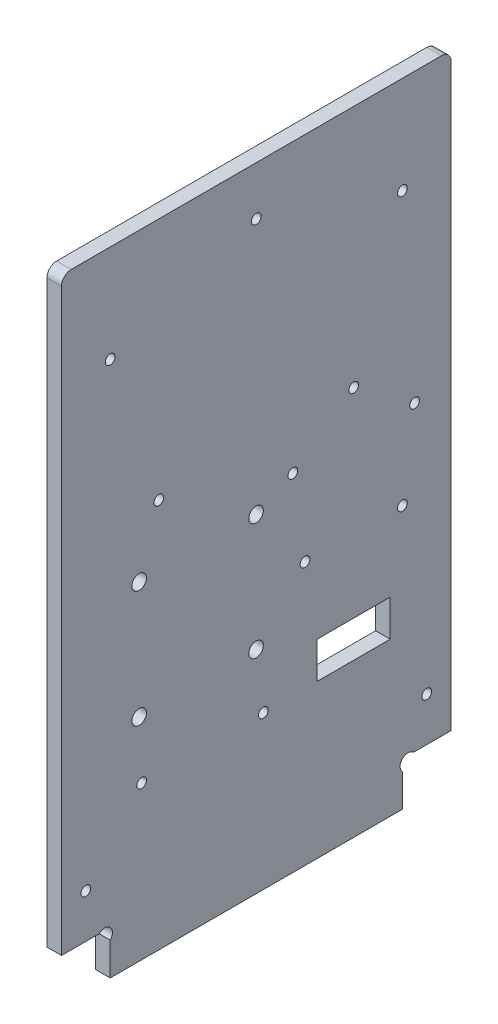
ISO-10303-21;
HEADER;
FILE_DESCRIPTION(('STEP AP214'),'2;1');
FILE_NAME('part.step','',(''),(''),'','','');
FILE_SCHEMA(('AUTOMOTIVE_DESIGN { 1 0 10303 214 1 1 1 1 }'));
ENDSEC;
DATA;
#1=APPLICATION_CONTEXT('core data for automotive mechanical design processes');
#2=APPLICATION_PROTOCOL_DEFINITION('international standard','automotive_design',2000,#1);
#3=PRODUCT_CONTEXT('',#1,'mechanical');
#4=PRODUCT('Part','Part','',(#3));
#5=PRODUCT_RELATED_PRODUCT_CATEGORY('part','',(#4));
#6=PRODUCT_DEFINITION_FORMATION('','',#4);
#7=PRODUCT_DEFINITION_CONTEXT('part definition',#1,'design');
#8=PRODUCT_DEFINITION('design','',#6,#7);
#9=PRODUCT_DEFINITION_SHAPE('','',#8);
#10=(LENGTH_UNIT() NAMED_UNIT(*) SI_UNIT(.MILLI.,.METRE.));
#11=(NAMED_UNIT(*) PLANE_ANGLE_UNIT() SI_UNIT($,.RADIAN.));
#12=(NAMED_UNIT(*) SI_UNIT($,.STERADIAN.) SOLID_ANGLE_UNIT());
#13=UNCERTAINTY_MEASURE_WITH_UNIT(LENGTH_MEASURE(1.E-05),#10,'distance_accuracy_value','');
#14=(GEOMETRIC_REPRESENTATION_CONTEXT(3) GLOBAL_UNCERTAINTY_ASSIGNED_CONTEXT((#13)) GLOBAL_UNIT_ASSIGNED_CONTEXT((#10,
#11,#12)) REPRESENTATION_CONTEXT('',''));
#15=CARTESIAN_POINT('',(0.,0.,0.));
#16=DIRECTION('',(0.,0.,1.));
#17=DIRECTION('',(1.,0.,0.));
#18=AXIS2_PLACEMENT_3D('',#15,#16,#17);
#19=CARTESIAN_POINT('',(3.,7.86862915010153,-8.86862915010152));
#20=DIRECTION('',(-1.,0.,0.));
#21=DIRECTION('',(0.,0.,1.));
#22=AXIS2_PLACEMENT_3D('',#19,#20,#21);
#23=CYLINDRICAL_SURFACE('',#22,1.6);
#24=CARTESIAN_POINT('',(0.,7.86862915010153,-8.86862915010152));
#25=DIRECTION('',(-1.,0.,0.));
#26=DIRECTION('',(0.,0.,-1.));
#27=AXIS2_PLACEMENT_3D('',#24,#25,#26);
#28=CIRCLE('',#27,1.6);
#29=CARTESIAN_POINT('',(0.,9.,-7.73725830020304));
#30=VERTEX_POINT('',#29);
#31=CARTESIAN_POINT('',(0.,6.73725830020305,-10.));
#32=VERTEX_POINT('',#31);
#33=EDGE_CURVE('E260',#30,#32,#28,.T.);
#34=ORIENTED_EDGE('',*,*,#33,.T.);
#35=DIRECTION('',(-1.,0.,0.));
#36=VECTOR('',#35,1.);
#37=CARTESIAN_POINT('',(3.,6.73725830020305,-10.));
#38=LINE('',#37,#36);
#39=CARTESIAN_POINT('',(3.,6.73725830020305,-10.));
#40=VERTEX_POINT('',#39);
#41=EDGE_CURVE('E326',#40,#32,#38,.T.);
#42=ORIENTED_EDGE('',*,*,#41,.F.);
#43=CARTESIAN_POINT('',(3.,7.86862915010153,-8.86862915010152));
#44=DIRECTION('',(-1.,0.,0.));
#45=DIRECTION('',(0.,0.,-1.));
#46=AXIS2_PLACEMENT_3D('',#43,#44,#45);
#47=CIRCLE('',#46,1.6);
#48=CARTESIAN_POINT('',(3.,9.,-7.73725830020304));
#49=VERTEX_POINT('',#48);
#50=EDGE_CURVE('E263',#49,#40,#47,.T.);
#51=ORIENTED_EDGE('',*,*,#50,.F.);
#52=DIRECTION('',(-1.,0.,0.));
#53=VECTOR('',#52,1.);
#54=CARTESIAN_POINT('',(3.,9.,-7.73725830020304));
#55=LINE('',#54,#53);
#56=EDGE_CURVE('E285',#49,#30,#55,.T.);
#57=ORIENTED_EDGE('',*,*,#56,.T.);
#58=EDGE_LOOP('',(#34,#42,#51,#57));
#59=FACE_BOUND('',#58,.T.);
#60=ADVANCED_FACE('F33',(#59),#23,.F.);
#61=CARTESIAN_POINT('',(3.,6.73725830020305,-10.));
#62=DIRECTION('',(0.,0.,-1.));
#63=DIRECTION('',(-1.,0.,0.));
#64=AXIS2_PLACEMENT_3D('',#61,#62,#63);
#65=PLANE('',#64);
#66=DIRECTION('',(0.,-1.,0.));
#67=VECTOR('',#66,1.);
#68=CARTESIAN_POINT('',(0.,6.73725830020305,-10.));
#69=LINE('',#68,#67);
#70=CARTESIAN_POINT('',(0.,0.,-10.));
#71=VERTEX_POINT('',#70);
#72=EDGE_CURVE('E288',#32,#71,#69,.T.);
#73=ORIENTED_EDGE('',*,*,#72,.T.);
#74=DIRECTION('',(-1.,0.,0.));
#75=VECTOR('',#74,1.);
#76=CARTESIAN_POINT('',(3.,0.,-10.));
#77=LINE('',#76,#75);
#78=CARTESIAN_POINT('',(3.,0.,-10.));
#79=VERTEX_POINT('',#78);
#80=EDGE_CURVE('E323',#79,#71,#77,.T.);
#81=ORIENTED_EDGE('',*,*,#80,.F.);
#82=DIRECTION('',(0.,-1.,0.));
#83=VECTOR('',#82,1.);
#84=CARTESIAN_POINT('',(3.,6.73725830020305,-10.));
#85=LINE('',#84,#83);
#86=EDGE_CURVE('E266',#40,#79,#85,.T.);
#87=ORIENTED_EDGE('',*,*,#86,.F.);
#88=ORIENTED_EDGE('',*,*,#41,.T.);
#89=EDGE_LOOP('',(#73,#81,#87,#88));
#90=FACE_BOUND('',#89,.T.);
#91=ADVANCED_FACE('F377',(#90),#65,.F.);
#92=CARTESIAN_POINT('',(3.,0.,-10.));
#93=DIRECTION('',(0.,1.,0.));
#94=DIRECTION('',(0.,0.,1.));
#95=AXIS2_PLACEMENT_3D('',#92,#93,#94);
#96=PLANE('',#95);
#97=DIRECTION('',(0.,0.,-1.));
#98=VECTOR('',#97,1.);
#99=CARTESIAN_POINT('',(0.,0.,-10.));
#100=LINE('',#99,#98);
#101=CARTESIAN_POINT('',(0.,0.,-70.));
#102=VERTEX_POINT('',#101);
#103=EDGE_CURVE('E290',#71,#102,#100,.T.);
#104=ORIENTED_EDGE('',*,*,#103,.T.);
#105=DIRECTION('',(-1.,0.,0.));
#106=VECTOR('',#105,1.);
#107=CARTESIAN_POINT('',(3.,0.,-70.));
#108=LINE('',#107,#106);
#109=CARTESIAN_POINT('',(3.,0.,-70.));
#110=VERTEX_POINT('',#109);
#111=EDGE_CURVE('E320',#110,#102,#108,.T.);
#112=ORIENTED_EDGE('',*,*,#111,.F.);
#113=DIRECTION('',(0.,0.,-1.));
#114=VECTOR('',#113,1.);
#115=CARTESIAN_POINT('',(3.,0.,-10.));
#116=LINE('',#115,#114);
#117=EDGE_CURVE('E269',#79,#110,#116,.T.);
#118=ORIENTED_EDGE('',*,*,#117,.F.);
#119=ORIENTED_EDGE('',*,*,#80,.T.);
#120=EDGE_LOOP('',(#104,#112,#118,#119));
#121=FACE_BOUND('',#120,.T.);
#122=ADVANCED_FACE('F371',(#121),#96,.F.);
#123=CARTESIAN_POINT('',(3.,6.73725830020307,-70.));
#124=DIRECTION('',(0.,0.,1.));
#125=DIRECTION('',(0.,-1.,0.));
#126=AXIS2_PLACEMENT_3D('',#123,#124,#125);
#127=PLANE('',#126);
#128=DIRECTION('',(0.,1.,0.));
#129=VECTOR('',#128,1.);
#130=CARTESIAN_POINT('',(0.,6.73725830020307,-70.));
#131=LINE('',#130,#129);
#132=CARTESIAN_POINT('',(0.,6.73725830020307,-70.));
#133=VERTEX_POINT('',#132);
#134=EDGE_CURVE('E292',#102,#133,#131,.T.);
#135=ORIENTED_EDGE('',*,*,#134,.T.);
#136=DIRECTION('',(-1.,0.,0.));
#137=VECTOR('',#136,1.);
#138=CARTESIAN_POINT('',(3.,6.73725830020307,-70.));
#139=LINE('',#138,#137);
#140=CARTESIAN_POINT('',(3.,6.73725830020307,-70.));
#141=VERTEX_POINT('',#140);
#142=EDGE_CURVE('E317',#141,#133,#139,.T.);
#143=ORIENTED_EDGE('',*,*,#142,.F.);
#144=DIRECTION('',(0.,1.,0.));
#145=VECTOR('',#144,1.);
#146=CARTESIAN_POINT('',(3.,6.73725830020307,-70.));
#147=LINE('',#146,#145);
#148=EDGE_CURVE('E271',#110,#141,#147,.T.);
#149=ORIENTED_EDGE('',*,*,#148,.F.);
#150=ORIENTED_EDGE('',*,*,#111,.T.);
#151=EDGE_LOOP('',(#135,#143,#149,#150));
#152=FACE_BOUND('',#151,.T.);
#153=ADVANCED_FACE('F367',(#152),#127,.F.);
#154=CARTESIAN_POINT('',(3.,7.86862915010154,-71.1313708498985));
#155=DIRECTION('',(-1.,0.,0.));
#156=DIRECTION('',(0.,0.,1.));
#157=AXIS2_PLACEMENT_3D('',#154,#155,#156);
#158=CYLINDRICAL_SURFACE('',#157,1.6);
#159=CARTESIAN_POINT('',(0.,7.86862915010154,-71.1313708498985));
#160=DIRECTION('',(-1.,0.,0.));
#161=DIRECTION('',(0.,0.,1.));
#162=AXIS2_PLACEMENT_3D('',#159,#160,#161);
#163=CIRCLE('',#162,1.6);
#164=CARTESIAN_POINT('',(0.,8.99999999999999,-72.262741699797));
#165=VERTEX_POINT('',#164);
#166=EDGE_CURVE('E294',#133,#165,#163,.T.);
#167=ORIENTED_EDGE('',*,*,#166,.T.);
#168=DIRECTION('',(-1.,0.,0.));
#169=VECTOR('',#168,1.);
#170=CARTESIAN_POINT('',(3.,8.99999999999999,-72.262741699797));
#171=LINE('',#170,#169);
#172=CARTESIAN_POINT('',(3.,8.99999999999999,-72.262741699797));
#173=VERTEX_POINT('',#172);
#174=EDGE_CURVE('E314',#173,#165,#171,.T.);
#175=ORIENTED_EDGE('',*,*,#174,.F.);
#176=CARTESIAN_POINT('',(3.,7.86862915010154,-71.1313708498985));
#177=DIRECTION('',(-1.,0.,0.));
#178=DIRECTION('',(0.,0.,1.));
#179=AXIS2_PLACEMENT_3D('',#176,#177,#178);
#180=CIRCLE('',#179,1.6);
#181=EDGE_CURVE('E273',#141,#173,#180,.T.);
#182=ORIENTED_EDGE('',*,*,#181,.F.);
#183=ORIENTED_EDGE('',*,*,#142,.T.);
#184=EDGE_LOOP('',(#167,#175,#182,#183));
#185=FACE_BOUND('',#184,.T.);
#186=ADVANCED_FACE('F362',(#185),#158,.F.);
#187=CARTESIAN_POINT('',(3.,8.99999999999999,-72.262741699797));
#188=DIRECTION('',(0.,1.,0.));
#189=DIRECTION('',(0.,0.,1.));
#190=AXIS2_PLACEMENT_3D('',#187,#188,#189);
#191=PLANE('',#190);
#192=DIRECTION('',(0.,0.,-1.));
#193=VECTOR('',#192,1.);
#194=CARTESIAN_POINT('',(0.,8.99999999999999,-72.262741699797));
#195=LINE('',#194,#193);
#196=CARTESIAN_POINT('',(0.,8.99999999999999,-80.));
#197=VERTEX_POINT('',#196);
#198=EDGE_CURVE('E296',#165,#197,#195,.T.);
#199=ORIENTED_EDGE('',*,*,#198,.T.);
#200=DIRECTION('',(-1.,0.,0.));
#201=VECTOR('',#200,1.);
#202=CARTESIAN_POINT('',(3.,8.99999999999999,-80.));
#203=LINE('',#202,#201);
#204=CARTESIAN_POINT('',(3.,8.99999999999999,-80.));
#205=VERTEX_POINT('',#204);
#206=EDGE_CURVE('E311',#205,#197,#203,.T.);
#207=ORIENTED_EDGE('',*,*,#206,.F.);
#208=DIRECTION('',(0.,0.,-1.));
#209=VECTOR('',#208,1.);
#210=CARTESIAN_POINT('',(3.,8.99999999999999,-72.262741699797));
#211=LINE('',#210,#209);
#212=EDGE_CURVE('E275',#173,#205,#211,.T.);
#213=ORIENTED_EDGE('',*,*,#212,.F.);
#214=ORIENTED_EDGE('',*,*,#174,.T.);
#215=EDGE_LOOP('',(#199,#207,#213,#214));
#216=FACE_BOUND('',#215,.T.);
#217=ADVANCED_FACE('F356',(#216),#191,.F.);
#218=CARTESIAN_POINT('',(3.,130.,-80.));
#219=DIRECTION('',(0.,0.,1.));
#220=DIRECTION('',(0.,-1.,0.));
#221=AXIS2_PLACEMENT_3D('',#218,#219,#220);
#222=PLANE('',#221);
#223=DIRECTION('',(0.,1.,0.));
#224=VECTOR('',#223,1.);
#225=CARTESIAN_POINT('',(0.,130.,-80.));
#226=LINE('',#225,#224);
#227=CARTESIAN_POINT('',(0.,128.,-80.));
#228=VERTEX_POINT('',#227);
#229=EDGE_CURVE('E298',#197,#228,#226,.T.);
#230=ORIENTED_EDGE('',*,*,#229,.T.);
#231=DIRECTION('',(-1.,0.,0.));
#232=VECTOR('',#231,1.);
#233=CARTESIAN_POINT('',(3.,128.,-80.));
#234=LINE('',#233,#232);
#235=CARTESIAN_POINT('',(3.,128.,-80.));
#236=VERTEX_POINT('',#235);
#237=EDGE_CURVE('E56',#228,#236,#234,.F.);
#238=ORIENTED_EDGE('',*,*,#237,.T.);
#239=DIRECTION('',(0.,1.,0.));
#240=VECTOR('',#239,1.);
#241=CARTESIAN_POINT('',(3.,130.,-80.));
#242=LINE('',#241,#240);
#243=EDGE_CURVE('E277',#205,#236,#242,.T.);
#244=ORIENTED_EDGE('',*,*,#243,.F.);
#245=ORIENTED_EDGE('',*,*,#206,.T.);
#246=EDGE_LOOP('',(#230,#238,#244,#245));
#247=FACE_BOUND('',#246,.T.);
#248=ADVANCED_FACE('F352',(#247),#222,.F.);
#249=CARTESIAN_POINT('',(3.,130.,0.));
#250=DIRECTION('',(0.,-1.,0.));
#251=DIRECTION('',(0.,0.,-1.));
#252=AXIS2_PLACEMENT_3D('',#249,#250,#251);
#253=PLANE('',#252);
#254=DIRECTION('',(0.,0.,1.));
#255=VECTOR('',#254,1.);
#256=CARTESIAN_POINT('',(3.,130.,0.));
#257=LINE('',#256,#255);
#258=CARTESIAN_POINT('',(3.,130.,-78.));
#259=VERTEX_POINT('',#258);
#260=CARTESIAN_POINT('',(3.,130.,-2.));
#261=VERTEX_POINT('',#260);
#262=EDGE_CURVE('E279',#259,#261,#257,.T.);
#263=ORIENTED_EDGE('',*,*,#262,.F.);
#264=DIRECTION('',(-1.,0.,0.));
#265=VECTOR('',#264,1.);
#266=CARTESIAN_POINT('',(3.,130.,-78.));
#267=LINE('',#266,#265);
#268=CARTESIAN_POINT('',(0.,130.,-78.));
#269=VERTEX_POINT('',#268);
#270=EDGE_CURVE('E331',#259,#269,#267,.T.);
#271=ORIENTED_EDGE('',*,*,#270,.T.);
#272=DIRECTION('',(0.,0.,1.));
#273=VECTOR('',#272,1.);
#274=CARTESIAN_POINT('',(0.,130.,0.));
#275=LINE('',#274,#273);
#276=CARTESIAN_POINT('',(0.,130.,-2.));
#277=VERTEX_POINT('',#276);
#278=EDGE_CURVE('E300',#269,#277,#275,.T.);
#279=ORIENTED_EDGE('',*,*,#278,.T.);
#280=DIRECTION('',(-1.,0.,0.));
#281=VECTOR('',#280,1.);
#282=CARTESIAN_POINT('',(3.,130.,-2.));
#283=LINE('',#282,#281);
#284=EDGE_CURVE('E329',#277,#261,#283,.F.);
#285=ORIENTED_EDGE('',*,*,#284,.T.);
#286=EDGE_LOOP('',(#263,#271,#279,#285));
#287=FACE_BOUND('',#286,.T.);
#288=ADVANCED_FACE('F344',(#287),#253,.F.);
#289=CARTESIAN_POINT('',(3.,9.,0.));
#290=DIRECTION('',(0.,0.,-1.));
#291=DIRECTION('',(-1.,0.,0.));
#292=AXIS2_PLACEMENT_3D('',#289,#290,#291);
#293=PLANE('',#292);
#294=DIRECTION('',(0.,-1.,0.));
#295=VECTOR('',#294,1.);
#296=CARTESIAN_POINT('',(3.,9.,0.));
#297=LINE('',#296,#295);
#298=CARTESIAN_POINT('',(3.,128.,0.));
#299=VERTEX_POINT('',#298);
#300=CARTESIAN_POINT('',(3.,9.,0.));
#301=VERTEX_POINT('',#300);
#302=EDGE_CURVE('E281',#299,#301,#297,.T.);
#303=ORIENTED_EDGE('',*,*,#302,.F.);
#304=DIRECTION('',(-1.,0.,0.));
#305=VECTOR('',#304,1.);
#306=CARTESIAN_POINT('',(3.,128.,0.));
#307=LINE('',#306,#305);
#308=CARTESIAN_POINT('',(0.,128.,0.));
#309=VERTEX_POINT('',#308);
#310=EDGE_CURVE('E11',#299,#309,#307,.T.);
#311=ORIENTED_EDGE('',*,*,#310,.T.);
#312=DIRECTION('',(0.,-1.,0.));
#313=VECTOR('',#312,1.);
#314=CARTESIAN_POINT('',(0.,9.,0.));
#315=LINE('',#314,#313);
#316=CARTESIAN_POINT('',(0.,9.,0.));
#317=VERTEX_POINT('',#316);
#318=EDGE_CURVE('E303',#309,#317,#315,.T.);
#319=ORIENTED_EDGE('',*,*,#318,.T.);
#320=DIRECTION('',(-1.,0.,0.));
#321=VECTOR('',#320,1.);
#322=CARTESIAN_POINT('',(3.,9.,0.));
#323=LINE('',#322,#321);
#324=EDGE_CURVE('E308',#301,#317,#323,.T.);
#325=ORIENTED_EDGE('',*,*,#324,.F.);
#326=EDGE_LOOP('',(#303,#311,#319,#325));
#327=FACE_BOUND('',#326,.T.);
#328=ADVANCED_FACE('F387',(#327),#293,.F.);
#329=CARTESIAN_POINT('',(3.,9.,-7.73725830020304));
#330=DIRECTION('',(0.,1.,0.));
#331=DIRECTION('',(0.,0.,1.));
#332=AXIS2_PLACEMENT_3D('',#329,#330,#331);
#333=PLANE('',#332);
#334=DIRECTION('',(0.,0.,-1.));
#335=VECTOR('',#334,1.);
#336=CARTESIAN_POINT('',(0.,9.,-7.73725830020304));
#337=LINE('',#336,#335);
#338=EDGE_CURVE('E267',#317,#30,#337,.T.);
#339=ORIENTED_EDGE('',*,*,#338,.T.);
#340=ORIENTED_EDGE('',*,*,#56,.F.);
#341=DIRECTION('',(0.,0.,-1.));
#342=VECTOR('',#341,1.);
#343=CARTESIAN_POINT('',(3.,9.,-7.73725830020304));
#344=LINE('',#343,#342);
#345=EDGE_CURVE('E283',#301,#49,#344,.T.);
#346=ORIENTED_EDGE('',*,*,#345,.F.);
#347=ORIENTED_EDGE('',*,*,#324,.T.);
#348=EDGE_LOOP('',(#339,#340,#346,#347));
#349=FACE_BOUND('',#348,.T.);
#350=ADVANCED_FACE('F383',(#349),#333,.F.);
#351=CARTESIAN_POINT('',(3.,7.86862915010153,-8.86862915010152));
#352=DIRECTION('',(1.,0.,0.));
#353=DIRECTION('',(0.,0.,-1.));
#354=AXIS2_PLACEMENT_3D('',#351,#352,#353);
#355=PLANE('',#354);
#356=CARTESIAN_POINT('',(3.,31.45,-16.45));
#357=DIRECTION('',(1.,0.,0.));
#358=DIRECTION('',(0.,0.,-1.));
#359=AXIS2_PLACEMENT_3D('',#356,#357,#358);
#360=CIRCLE('',#359,1.);
#361=CARTESIAN_POINT('',(3.,31.45,-17.45));
#362=VERTEX_POINT('',#361);
#363=EDGE_CURVE('E510',#362,#362,#360,.T.);
#364=ORIENTED_EDGE('',*,*,#363,.F.);
#365=EDGE_LOOP('',(#364));
#366=FACE_BOUND('',#365,.T.);
#367=CARTESIAN_POINT('',(3.,31.45,-41.45));
#368=DIRECTION('',(1.,0.,0.));
#369=DIRECTION('',(0.,0.,-1.));
#370=AXIS2_PLACEMENT_3D('',#367,#368,#369);
#371=CIRCLE('',#370,0.999999999999998);
#372=CARTESIAN_POINT('',(3.,31.45,-42.45));
#373=VERTEX_POINT('',#372);
#374=EDGE_CURVE('E515',#373,#373,#371,.T.);
#375=ORIENTED_EDGE('',*,*,#374,.F.);
#376=EDGE_LOOP('',(#375));
#377=FACE_BOUND('',#376,.T.);
#378=CARTESIAN_POINT('',(3.,71.,-47.5));
#379=DIRECTION('',(1.,0.,0.));
#380=DIRECTION('',(0.,0.,-1.));
#381=AXIS2_PLACEMENT_3D('',#378,#379,#380);
#382=CIRCLE('',#381,0.999999999999998);
#383=CARTESIAN_POINT('',(3.,71.,-48.5));
#384=VERTEX_POINT('',#383);
#385=EDGE_CURVE('E523',#384,#384,#382,.T.);
#386=ORIENTED_EDGE('',*,*,#385,.F.);
#387=EDGE_LOOP('',(#386));
#388=FACE_BOUND('',#387,.T.);
#389=CARTESIAN_POINT('',(3.,71.,-72.5));
#390=DIRECTION('',(1.,0.,0.));
#391=DIRECTION('',(0.,0.,-1.));
#392=AXIS2_PLACEMENT_3D('',#389,#390,#391);
#393=CIRCLE('',#392,0.999999999999998);
#394=CARTESIAN_POINT('',(3.,71.,-73.5));
#395=VERTEX_POINT('',#394);
#396=EDGE_CURVE('E529',#395,#395,#393,.T.);
#397=ORIENTED_EDGE('',*,*,#396,.F.);
#398=EDGE_LOOP('',(#397));
#399=FACE_BOUND('',#398,.T.);
#400=CARTESIAN_POINT('',(3.,18.,-75.));
#401=DIRECTION('',(1.,0.,0.));
#402=DIRECTION('',(0.,0.,-1.));
#403=AXIS2_PLACEMENT_3D('',#400,#401,#402);
#404=CIRCLE('',#403,0.999999999999998);
#405=CARTESIAN_POINT('',(3.,18.,-76.));
#406=VERTEX_POINT('',#405);
#407=EDGE_CURVE('E534',#406,#406,#404,.T.);
#408=ORIENTED_EDGE('',*,*,#407,.F.);
#409=EDGE_LOOP('',(#408));
#410=FACE_BOUND('',#409,.T.);
#411=CARTESIAN_POINT('',(3.,18.,-5.));
#412=DIRECTION('',(1.,0.,0.));
#413=DIRECTION('',(0.,0.,-1.));
#414=AXIS2_PLACEMENT_3D('',#411,#412,#413);
#415=CIRCLE('',#414,1.);
#416=CARTESIAN_POINT('',(3.,18.,-6.));
#417=VERTEX_POINT('',#416);
#418=EDGE_CURVE('E180',#417,#417,#415,.T.);
#419=ORIENTED_EDGE('',*,*,#418,.F.);
#420=EDGE_LOOP('',(#419));
#421=FACE_BOUND('',#420,.T.);
#422=DIRECTION('',(0.,-1.,0.));
#423=VECTOR('',#422,1.);
#424=CARTESIAN_POINT('',(3.,39.,-67.5));
#425=LINE('',#424,#423);
#426=CARTESIAN_POINT('',(3.,39.,-67.5));
#427=VERTEX_POINT('',#426);
#428=CARTESIAN_POINT('',(3.,31.5,-67.5));
#429=VERTEX_POINT('',#428);
#430=EDGE_CURVE('E153',#427,#429,#425,.T.);
#431=ORIENTED_EDGE('',*,*,#430,.T.);
#432=DIRECTION('',(0.,0.,1.));
#433=VECTOR('',#432,1.);
#434=CARTESIAN_POINT('',(3.,31.5,-67.5));
#435=LINE('',#434,#433);
#436=CARTESIAN_POINT('',(3.,31.5,-52.5));
#437=VERTEX_POINT('',#436);
#438=EDGE_CURVE('E165',#429,#437,#435,.T.);
#439=ORIENTED_EDGE('',*,*,#438,.T.);
#440=DIRECTION('',(0.,1.,0.));
#441=VECTOR('',#440,1.);
#442=CARTESIAN_POINT('',(3.,39.,-52.5));
#443=LINE('',#442,#441);
#444=CARTESIAN_POINT('',(3.,39.,-52.5));
#445=VERTEX_POINT('',#444);
#446=EDGE_CURVE('E169',#437,#445,#443,.T.);
#447=ORIENTED_EDGE('',*,*,#446,.T.);
#448=DIRECTION('',(0.,0.,-1.));
#449=VECTOR('',#448,1.);
#450=CARTESIAN_POINT('',(3.,39.,-67.5));
#451=LINE('',#450,#449);
#452=EDGE_CURVE('E161',#445,#427,#451,.T.);
#453=ORIENTED_EDGE('',*,*,#452,.T.);
#454=EDGE_LOOP('',(#431,#439,#447,#453));
#455=FACE_BOUND('',#454,.T.);
#456=CARTESIAN_POINT('',(3.,67.45,-39.95));
#457=DIRECTION('',(1.,0.,0.));
#458=DIRECTION('',(0.,0.,-1.));
#459=AXIS2_PLACEMENT_3D('',#456,#457,#458);
#460=CIRCLE('',#459,1.5);
#461=CARTESIAN_POINT('',(3.,67.45,-41.45));
#462=VERTEX_POINT('',#461);
#463=EDGE_CURVE('E193',#462,#462,#460,.T.);
#464=ORIENTED_EDGE('',*,*,#463,.F.);
#465=EDGE_LOOP('',(#464));
#466=FACE_BOUND('',#465,.T.);
#467=CARTESIAN_POINT('',(3.,43.45,-39.95));
#468=DIRECTION('',(1.,0.,0.));
#469=DIRECTION('',(0.,0.,-1.));
#470=AXIS2_PLACEMENT_3D('',#467,#468,#469);
#471=CIRCLE('',#470,1.5);
#472=CARTESIAN_POINT('',(3.,43.45,-41.45));
#473=VERTEX_POINT('',#472);
#474=EDGE_CURVE('E200',#473,#473,#471,.T.);
#475=ORIENTED_EDGE('',*,*,#474,.F.);
#476=EDGE_LOOP('',(#475));
#477=FACE_BOUND('',#476,.T.);
#478=CARTESIAN_POINT('',(3.,43.45,-15.95));
#479=DIRECTION('',(1.,0.,0.));
#480=DIRECTION('',(0.,0.,-1.));
#481=AXIS2_PLACEMENT_3D('',#478,#479,#480);
#482=CIRCLE('',#481,1.5);
#483=CARTESIAN_POINT('',(3.,43.45,-17.45));
#484=VERTEX_POINT('',#483);
#485=EDGE_CURVE('E206',#484,#484,#482,.T.);
#486=ORIENTED_EDGE('',*,*,#485,.F.);
#487=EDGE_LOOP('',(#486));
#488=FACE_BOUND('',#487,.T.);
#489=CARTESIAN_POINT('',(3.,67.45,-15.95));
#490=DIRECTION('',(1.,0.,0.));
#491=DIRECTION('',(0.,0.,-1.));
#492=AXIS2_PLACEMENT_3D('',#489,#490,#491);
#493=CIRCLE('',#492,1.5);
#494=CARTESIAN_POINT('',(3.,67.45,-17.45));
#495=VERTEX_POINT('',#494);
#496=EDGE_CURVE('E212',#495,#495,#493,.T.);
#497=ORIENTED_EDGE('',*,*,#496,.F.);
#498=EDGE_LOOP('',(#497));
#499=FACE_BOUND('',#498,.T.);
#500=CARTESIAN_POINT('',(3.,120.,-40.));
#501=DIRECTION('',(1.,0.,0.));
#502=DIRECTION('',(0.,0.,-1.));
#503=AXIS2_PLACEMENT_3D('',#500,#501,#502);
#504=CIRCLE('',#503,0.999999999999998);
#505=CARTESIAN_POINT('',(3.,120.,-41.));
#506=VERTEX_POINT('',#505);
#507=EDGE_CURVE('E218',#506,#506,#504,.T.);
#508=ORIENTED_EDGE('',*,*,#507,.F.);
#509=EDGE_LOOP('',(#508));
#510=FACE_BOUND('',#509,.T.);
#511=CARTESIAN_POINT('',(3.,80.,-20.));
#512=DIRECTION('',(1.,0.,0.));
#513=DIRECTION('',(0.,0.,1.));
#514=AXIS2_PLACEMENT_3D('',#511,#512,#513);
#515=CIRCLE('',#514,1.);
#516=CARTESIAN_POINT('',(3.,80.,-19.));
#517=VERTEX_POINT('',#516);
#518=EDGE_CURVE('E224',#517,#517,#515,.T.);
#519=ORIENTED_EDGE('',*,*,#518,.F.);
#520=EDGE_LOOP('',(#519));
#521=FACE_BOUND('',#520,.T.);
#522=CARTESIAN_POINT('',(3.,54.,-70.));
#523=DIRECTION('',(1.,0.,0.));
#524=DIRECTION('',(0.,0.,-1.));
#525=AXIS2_PLACEMENT_3D('',#522,#523,#524);
#526=CIRCLE('',#525,0.999999999999998);
#527=CARTESIAN_POINT('',(3.,54.,-71.));
#528=VERTEX_POINT('',#527);
#529=EDGE_CURVE('E230',#528,#528,#526,.T.);
#530=ORIENTED_EDGE('',*,*,#529,.F.);
#531=EDGE_LOOP('',(#530));
#532=FACE_BOUND('',#531,.T.);
#533=CARTESIAN_POINT('',(3.,54.,-50.));
#534=DIRECTION('',(1.,0.,0.));
#535=DIRECTION('',(0.,0.,-1.));
#536=AXIS2_PLACEMENT_3D('',#533,#534,#535);
#537=CIRCLE('',#536,0.999999999999998);
#538=CARTESIAN_POINT('',(3.,54.,-51.));
#539=VERTEX_POINT('',#538);
#540=EDGE_CURVE('E236',#539,#539,#537,.T.);
#541=ORIENTED_EDGE('',*,*,#540,.F.);
#542=EDGE_LOOP('',(#541));
#543=FACE_BOUND('',#542,.T.);
#544=CARTESIAN_POINT('',(3.,110.,-70.));
#545=DIRECTION('',(1.,0.,0.));
#546=DIRECTION('',(0.,0.,-1.));
#547=AXIS2_PLACEMENT_3D('',#544,#545,#546);
#548=CIRCLE('',#547,0.999999999999998);
#549=CARTESIAN_POINT('',(3.,110.,-71.));
#550=VERTEX_POINT('',#549);
#551=EDGE_CURVE('E242',#550,#550,#548,.T.);
#552=ORIENTED_EDGE('',*,*,#551,.F.);
#553=EDGE_LOOP('',(#552));
#554=FACE_BOUND('',#553,.T.);
#555=CARTESIAN_POINT('',(3.,80.,-60.));
#556=DIRECTION('',(1.,0.,0.));
#557=DIRECTION('',(0.,0.,-1.));
#558=AXIS2_PLACEMENT_3D('',#555,#556,#557);
#559=CIRCLE('',#558,0.999999999999998);
#560=CARTESIAN_POINT('',(3.,80.,-61.));
#561=VERTEX_POINT('',#560);
#562=EDGE_CURVE('E248',#561,#561,#559,.T.);
#563=ORIENTED_EDGE('',*,*,#562,.F.);
#564=EDGE_LOOP('',(#563));
#565=FACE_BOUND('',#564,.T.);
#566=CARTESIAN_POINT('',(3.,110.,-10.));
#567=DIRECTION('',(1.,0.,0.));
#568=DIRECTION('',(0.,0.,-1.));
#569=AXIS2_PLACEMENT_3D('',#566,#567,#568);
#570=CIRCLE('',#569,1.);
#571=CARTESIAN_POINT('',(3.,110.,-11.));
#572=VERTEX_POINT('',#571);
#573=EDGE_CURVE('E254',#572,#572,#570,.T.);
#574=ORIENTED_EDGE('',*,*,#573,.F.);
#575=EDGE_LOOP('',(#574));
#576=FACE_BOUND('',#575,.T.);
#577=ORIENTED_EDGE('',*,*,#243,.T.);
#578=CARTESIAN_POINT('',(3.,128.,-78.));
#579=DIRECTION('',(1.,0.,0.));
#580=DIRECTION('',(0.,0.,-1.));
#581=AXIS2_PLACEMENT_3D('',#578,#579,#580);
#582=CIRCLE('',#581,2.);
#583=EDGE_CURVE('E41',#236,#259,#582,.T.);
#584=ORIENTED_EDGE('',*,*,#583,.T.);
#585=ORIENTED_EDGE('',*,*,#262,.T.);
#586=CARTESIAN_POINT('',(3.,128.,-2.));
#587=DIRECTION('',(1.,0.,0.));
#588=DIRECTION('',(0.,0.,-1.));
#589=AXIS2_PLACEMENT_3D('',#586,#587,#588);
#590=CIRCLE('',#589,2.);
#591=EDGE_CURVE('E48',#261,#299,#590,.T.);
#592=ORIENTED_EDGE('',*,*,#591,.T.);
#593=ORIENTED_EDGE('',*,*,#302,.T.);
#594=ORIENTED_EDGE('',*,*,#345,.T.);
#595=ORIENTED_EDGE('',*,*,#50,.T.);
#596=ORIENTED_EDGE('',*,*,#86,.T.);
#597=ORIENTED_EDGE('',*,*,#117,.T.);
#598=ORIENTED_EDGE('',*,*,#148,.T.);
#599=ORIENTED_EDGE('',*,*,#181,.T.);
#600=ORIENTED_EDGE('',*,*,#212,.T.);
#601=EDGE_LOOP('',(#577,#584,#585,#592,#593,#594,#595,#596,#597,#598,#599,#600));
#602=FACE_BOUND('',#601,.T.);
#603=ADVANCED_FACE('F171',(#366,#377,#388,#399,#410,#421,#455,#466,#477,#488,#499,#510,#521,
#532,#543,#554,#565,#576,#602),#355,.T.);
#604=CARTESIAN_POINT('',(0.,7.86862915010153,-8.86862915010152));
#605=DIRECTION('',(1.,0.,0.));
#606=DIRECTION('',(0.,0.,-1.));
#607=AXIS2_PLACEMENT_3D('',#604,#605,#606);
#608=PLANE('',#607);
#609=CARTESIAN_POINT('',(0.,31.45,-16.45));
#610=DIRECTION('',(1.,0.,0.));
#611=DIRECTION('',(0.,0.,-1.));
#612=AXIS2_PLACEMENT_3D('',#609,#610,#611);
#613=CIRCLE('',#612,1.);
#614=CARTESIAN_POINT('',(0.,31.45,-17.45));
#615=VERTEX_POINT('',#614);
#616=EDGE_CURVE('E507',#615,#615,#613,.T.);
#617=ORIENTED_EDGE('',*,*,#616,.T.);
#618=EDGE_LOOP('',(#617));
#619=FACE_BOUND('',#618,.T.);
#620=CARTESIAN_POINT('',(0.,31.45,-41.45));
#621=DIRECTION('',(1.,0.,0.));
#622=DIRECTION('',(0.,0.,-1.));
#623=AXIS2_PLACEMENT_3D('',#620,#621,#622);
#624=CIRCLE('',#623,0.999999999999998);
#625=CARTESIAN_POINT('',(0.,31.45,-42.45));
#626=VERTEX_POINT('',#625);
#627=EDGE_CURVE('E511',#626,#626,#624,.T.);
#628=ORIENTED_EDGE('',*,*,#627,.T.);
#629=EDGE_LOOP('',(#628));
#630=FACE_BOUND('',#629,.T.);
#631=CARTESIAN_POINT('',(0.,71.,-47.5));
#632=DIRECTION('',(1.,0.,0.));
#633=DIRECTION('',(0.,0.,-1.));
#634=AXIS2_PLACEMENT_3D('',#631,#632,#633);
#635=CIRCLE('',#634,0.999999999999998);
#636=CARTESIAN_POINT('',(0.,71.,-48.5));
#637=VERTEX_POINT('',#636);
#638=EDGE_CURVE('E520',#637,#637,#635,.T.);
#639=ORIENTED_EDGE('',*,*,#638,.T.);
#640=EDGE_LOOP('',(#639));
#641=FACE_BOUND('',#640,.T.);
#642=CARTESIAN_POINT('',(0.,71.,-72.5));
#643=DIRECTION('',(1.,0.,0.));
#644=DIRECTION('',(0.,0.,-1.));
#645=AXIS2_PLACEMENT_3D('',#642,#643,#644);
#646=CIRCLE('',#645,0.999999999999998);
#647=CARTESIAN_POINT('',(0.,71.,-73.5));
#648=VERTEX_POINT('',#647);
#649=EDGE_CURVE('E526',#648,#648,#646,.T.);
#650=ORIENTED_EDGE('',*,*,#649,.T.);
#651=EDGE_LOOP('',(#650));
#652=FACE_BOUND('',#651,.T.);
#653=CARTESIAN_POINT('',(0.,18.,-75.));
#654=DIRECTION('',(1.,0.,0.));
#655=DIRECTION('',(0.,0.,-1.));
#656=AXIS2_PLACEMENT_3D('',#653,#654,#655);
#657=CIRCLE('',#656,0.999999999999998);
#658=CARTESIAN_POINT('',(0.,18.,-76.));
#659=VERTEX_POINT('',#658);
#660=EDGE_CURVE('E187',#659,#659,#657,.T.);
#661=ORIENTED_EDGE('',*,*,#660,.T.);
#662=EDGE_LOOP('',(#661));
#663=FACE_BOUND('',#662,.T.);
#664=CARTESIAN_POINT('',(0.,18.,-5.));
#665=DIRECTION('',(1.,0.,0.));
#666=DIRECTION('',(0.,0.,-1.));
#667=AXIS2_PLACEMENT_3D('',#664,#665,#666);
#668=CIRCLE('',#667,1.);
#669=CARTESIAN_POINT('',(0.,18.,-6.));
#670=VERTEX_POINT('',#669);
#671=EDGE_CURVE('E536',#670,#670,#668,.T.);
#672=ORIENTED_EDGE('',*,*,#671,.T.);
#673=EDGE_LOOP('',(#672));
#674=FACE_BOUND('',#673,.T.);
#675=DIRECTION('',(0.,0.,1.));
#676=VECTOR('',#675,1.);
#677=CARTESIAN_POINT('',(0.,31.5,-67.5));
#678=LINE('',#677,#676);
#679=CARTESIAN_POINT('',(0.,31.5,-67.5));
#680=VERTEX_POINT('',#679);
#681=CARTESIAN_POINT('',(0.,31.5,-52.5));
#682=VERTEX_POINT('',#681);
#683=EDGE_CURVE('E186',#680,#682,#678,.T.);
#684=ORIENTED_EDGE('',*,*,#683,.F.);
#685=DIRECTION('',(0.,-1.,0.));
#686=VECTOR('',#685,1.);
#687=CARTESIAN_POINT('',(0.,39.,-67.5));
#688=LINE('',#687,#686);
#689=CARTESIAN_POINT('',(0.,39.,-67.5));
#690=VERTEX_POINT('',#689);
#691=EDGE_CURVE('E156',#690,#680,#688,.T.);
#692=ORIENTED_EDGE('',*,*,#691,.F.);
#693=DIRECTION('',(0.,0.,-1.));
#694=VECTOR('',#693,1.);
#695=CARTESIAN_POINT('',(0.,39.,-67.5));
#696=LINE('',#695,#694);
#697=CARTESIAN_POINT('',(0.,39.,-52.5));
#698=VERTEX_POINT('',#697);
#699=EDGE_CURVE('E174',#698,#690,#696,.T.);
#700=ORIENTED_EDGE('',*,*,#699,.F.);
#701=DIRECTION('',(0.,1.,0.));
#702=VECTOR('',#701,1.);
#703=CARTESIAN_POINT('',(0.,39.,-52.5));
#704=LINE('',#703,#702);
#705=EDGE_CURVE('E177',#682,#698,#704,.T.);
#706=ORIENTED_EDGE('',*,*,#705,.F.);
#707=EDGE_LOOP('',(#684,#692,#700,#706));
#708=FACE_BOUND('',#707,.T.);
#709=CARTESIAN_POINT('',(0.,67.45,-39.95));
#710=DIRECTION('',(1.,0.,0.));
#711=DIRECTION('',(0.,0.,-1.));
#712=AXIS2_PLACEMENT_3D('',#709,#710,#711);
#713=CIRCLE('',#712,1.5);
#714=CARTESIAN_POINT('',(0.,67.45,-41.45));
#715=VERTEX_POINT('',#714);
#716=EDGE_CURVE('E197',#715,#715,#713,.T.);
#717=ORIENTED_EDGE('',*,*,#716,.T.);
#718=EDGE_LOOP('',(#717));
#719=FACE_BOUND('',#718,.T.);
#720=CARTESIAN_POINT('',(0.,43.45,-39.95));
#721=DIRECTION('',(1.,0.,0.));
#722=DIRECTION('',(0.,0.,-1.));
#723=AXIS2_PLACEMENT_3D('',#720,#721,#722);
#724=CIRCLE('',#723,1.5);
#725=CARTESIAN_POINT('',(0.,43.45,-41.45));
#726=VERTEX_POINT('',#725);
#727=EDGE_CURVE('E203',#726,#726,#724,.T.);
#728=ORIENTED_EDGE('',*,*,#727,.T.);
#729=EDGE_LOOP('',(#728));
#730=FACE_BOUND('',#729,.T.);
#731=CARTESIAN_POINT('',(0.,43.45,-15.95));
#732=DIRECTION('',(1.,0.,0.));
#733=DIRECTION('',(0.,0.,-1.));
#734=AXIS2_PLACEMENT_3D('',#731,#732,#733);
#735=CIRCLE('',#734,1.5);
#736=CARTESIAN_POINT('',(0.,43.45,-17.45));
#737=VERTEX_POINT('',#736);
#738=EDGE_CURVE('E209',#737,#737,#735,.T.);
#739=ORIENTED_EDGE('',*,*,#738,.T.);
#740=EDGE_LOOP('',(#739));
#741=FACE_BOUND('',#740,.T.);
#742=CARTESIAN_POINT('',(0.,67.45,-15.95));
#743=DIRECTION('',(1.,0.,0.));
#744=DIRECTION('',(0.,0.,-1.));
#745=AXIS2_PLACEMENT_3D('',#742,#743,#744);
#746=CIRCLE('',#745,1.5);
#747=CARTESIAN_POINT('',(0.,67.45,-17.45));
#748=VERTEX_POINT('',#747);
#749=EDGE_CURVE('E215',#748,#748,#746,.T.);
#750=ORIENTED_EDGE('',*,*,#749,.T.);
#751=EDGE_LOOP('',(#750));
#752=FACE_BOUND('',#751,.T.);
#753=CARTESIAN_POINT('',(0.,120.,-40.));
#754=DIRECTION('',(1.,0.,0.));
#755=DIRECTION('',(0.,0.,-1.));
#756=AXIS2_PLACEMENT_3D('',#753,#754,#755);
#757=CIRCLE('',#756,0.999999999999998);
#758=CARTESIAN_POINT('',(0.,120.,-41.));
#759=VERTEX_POINT('',#758);
#760=EDGE_CURVE('E221',#759,#759,#757,.T.);
#761=ORIENTED_EDGE('',*,*,#760,.T.);
#762=EDGE_LOOP('',(#761));
#763=FACE_BOUND('',#762,.T.);
#764=CARTESIAN_POINT('',(0.,80.,-20.));
#765=DIRECTION('',(1.,0.,0.));
#766=DIRECTION('',(0.,0.,1.));
#767=AXIS2_PLACEMENT_3D('',#764,#765,#766);
#768=CIRCLE('',#767,1.);
#769=CARTESIAN_POINT('',(0.,80.,-19.));
#770=VERTEX_POINT('',#769);
#771=EDGE_CURVE('E227',#770,#770,#768,.T.);
#772=ORIENTED_EDGE('',*,*,#771,.T.);
#773=EDGE_LOOP('',(#772));
#774=FACE_BOUND('',#773,.T.);
#775=CARTESIAN_POINT('',(0.,54.,-70.));
#776=DIRECTION('',(1.,0.,0.));
#777=DIRECTION('',(0.,0.,-1.));
#778=AXIS2_PLACEMENT_3D('',#775,#776,#777);
#779=CIRCLE('',#778,0.999999999999998);
#780=CARTESIAN_POINT('',(0.,54.,-71.));
#781=VERTEX_POINT('',#780);
#782=EDGE_CURVE('E233',#781,#781,#779,.T.);
#783=ORIENTED_EDGE('',*,*,#782,.T.);
#784=EDGE_LOOP('',(#783));
#785=FACE_BOUND('',#784,.T.);
#786=CARTESIAN_POINT('',(0.,54.,-50.));
#787=DIRECTION('',(1.,0.,0.));
#788=DIRECTION('',(0.,0.,-1.));
#789=AXIS2_PLACEMENT_3D('',#786,#787,#788);
#790=CIRCLE('',#789,0.999999999999998);
#791=CARTESIAN_POINT('',(0.,54.,-51.));
#792=VERTEX_POINT('',#791);
#793=EDGE_CURVE('E239',#792,#792,#790,.T.);
#794=ORIENTED_EDGE('',*,*,#793,.T.);
#795=EDGE_LOOP('',(#794));
#796=FACE_BOUND('',#795,.T.);
#797=CARTESIAN_POINT('',(0.,110.,-70.));
#798=DIRECTION('',(1.,0.,0.));
#799=DIRECTION('',(0.,0.,-1.));
#800=AXIS2_PLACEMENT_3D('',#797,#798,#799);
#801=CIRCLE('',#800,0.999999999999998);
#802=CARTESIAN_POINT('',(0.,110.,-71.));
#803=VERTEX_POINT('',#802);
#804=EDGE_CURVE('E245',#803,#803,#801,.T.);
#805=ORIENTED_EDGE('',*,*,#804,.T.);
#806=EDGE_LOOP('',(#805));
#807=FACE_BOUND('',#806,.T.);
#808=CARTESIAN_POINT('',(0.,80.,-60.));
#809=DIRECTION('',(1.,0.,0.));
#810=DIRECTION('',(0.,0.,-1.));
#811=AXIS2_PLACEMENT_3D('',#808,#809,#810);
#812=CIRCLE('',#811,0.999999999999998);
#813=CARTESIAN_POINT('',(0.,80.,-61.));
#814=VERTEX_POINT('',#813);
#815=EDGE_CURVE('E251',#814,#814,#812,.T.);
#816=ORIENTED_EDGE('',*,*,#815,.T.);
#817=EDGE_LOOP('',(#816));
#818=FACE_BOUND('',#817,.T.);
#819=CARTESIAN_POINT('',(0.,110.,-10.));
#820=DIRECTION('',(1.,0.,0.));
#821=DIRECTION('',(0.,0.,-1.));
#822=AXIS2_PLACEMENT_3D('',#819,#820,#821);
#823=CIRCLE('',#822,1.);
#824=CARTESIAN_POINT('',(0.,110.,-11.));
#825=VERTEX_POINT('',#824);
#826=EDGE_CURVE('E257',#825,#825,#823,.T.);
#827=ORIENTED_EDGE('',*,*,#826,.T.);
#828=EDGE_LOOP('',(#827));
#829=FACE_BOUND('',#828,.T.);
#830=ORIENTED_EDGE('',*,*,#278,.F.);
#831=CARTESIAN_POINT('',(0.,128.,-78.));
#832=DIRECTION('',(1.,0.,0.));
#833=DIRECTION('',(0.,0.,-1.));
#834=AXIS2_PLACEMENT_3D('',#831,#832,#833);
#835=CIRCLE('',#834,2.);
#836=EDGE_CURVE('E336',#269,#228,#835,.F.);
#837=ORIENTED_EDGE('',*,*,#836,.T.);
#838=ORIENTED_EDGE('',*,*,#229,.F.);
#839=ORIENTED_EDGE('',*,*,#198,.F.);
#840=ORIENTED_EDGE('',*,*,#166,.F.);
#841=ORIENTED_EDGE('',*,*,#134,.F.);
#842=ORIENTED_EDGE('',*,*,#103,.F.);
#843=ORIENTED_EDGE('',*,*,#72,.F.);
#844=ORIENTED_EDGE('',*,*,#33,.F.);
#845=ORIENTED_EDGE('',*,*,#338,.F.);
#846=ORIENTED_EDGE('',*,*,#318,.F.);
#847=CARTESIAN_POINT('',(0.,128.,-2.));
#848=DIRECTION('',(1.,0.,0.));
#849=DIRECTION('',(0.,0.,-1.));
#850=AXIS2_PLACEMENT_3D('',#847,#848,#849);
#851=CIRCLE('',#850,2.);
#852=EDGE_CURVE('E334',#309,#277,#851,.F.);
#853=ORIENTED_EDGE('',*,*,#852,.T.);
#854=EDGE_LOOP('',(#830,#837,#838,#839,#840,#841,#842,#843,#844,#845,#846,#853));
#855=FACE_BOUND('',#854,.T.);
#856=ADVANCED_FACE('F350',(#619,#630,#641,#652,#663,#674,#708,#719,#730,#741,#752,#763,#774,
#785,#796,#807,#818,#829,#855),#608,.F.);
#857=CARTESIAN_POINT('',(0.,110.,-10.));
#858=DIRECTION('',(1.,0.,0.));
#859=DIRECTION('',(0.,0.,-1.));
#860=AXIS2_PLACEMENT_3D('',#857,#858,#859);
#861=CYLINDRICAL_SURFACE('',#860,1.);
#862=ORIENTED_EDGE('',*,*,#826,.F.);
#863=EDGE_LOOP('',(#862));
#864=FACE_BOUND('',#863,.T.);
#865=ORIENTED_EDGE('',*,*,#573,.T.);
#866=EDGE_LOOP('',(#865));
#867=FACE_BOUND('',#866,.T.);
#868=ADVANCED_FACE('F425',(#864,#867),#861,.F.);
#869=CARTESIAN_POINT('',(0.,80.,-60.));
#870=DIRECTION('',(1.,0.,0.));
#871=DIRECTION('',(0.,0.,-1.));
#872=AXIS2_PLACEMENT_3D('',#869,#870,#871);
#873=CYLINDRICAL_SURFACE('',#872,0.999999999999998);
#874=ORIENTED_EDGE('',*,*,#815,.F.);
#875=EDGE_LOOP('',(#874));
#876=FACE_BOUND('',#875,.T.);
#877=ORIENTED_EDGE('',*,*,#562,.T.);
#878=EDGE_LOOP('',(#877));
#879=FACE_BOUND('',#878,.T.);
#880=ADVANCED_FACE('F432',(#876,#879),#873,.F.);
#881=CARTESIAN_POINT('',(0.,110.,-70.));
#882=DIRECTION('',(1.,0.,0.));
#883=DIRECTION('',(0.,0.,-1.));
#884=AXIS2_PLACEMENT_3D('',#881,#882,#883);
#885=CYLINDRICAL_SURFACE('',#884,0.999999999999998);
#886=ORIENTED_EDGE('',*,*,#804,.F.);
#887=EDGE_LOOP('',(#886));
#888=FACE_BOUND('',#887,.T.);
#889=ORIENTED_EDGE('',*,*,#551,.T.);
#890=EDGE_LOOP('',(#889));
#891=FACE_BOUND('',#890,.T.);
#892=ADVANCED_FACE('F436',(#888,#891),#885,.F.);
#893=CARTESIAN_POINT('',(0.,54.,-50.));
#894=DIRECTION('',(1.,0.,0.));
#895=DIRECTION('',(0.,0.,-1.));
#896=AXIS2_PLACEMENT_3D('',#893,#894,#895);
#897=CYLINDRICAL_SURFACE('',#896,0.999999999999998);
#898=ORIENTED_EDGE('',*,*,#793,.F.);
#899=EDGE_LOOP('',(#898));
#900=FACE_BOUND('',#899,.T.);
#901=ORIENTED_EDGE('',*,*,#540,.T.);
#902=EDGE_LOOP('',(#901));
#903=FACE_BOUND('',#902,.T.);
#904=ADVANCED_FACE('F440',(#900,#903),#897,.F.);
#905=CARTESIAN_POINT('',(0.,54.,-70.));
#906=DIRECTION('',(1.,0.,0.));
#907=DIRECTION('',(0.,0.,-1.));
#908=AXIS2_PLACEMENT_3D('',#905,#906,#907);
#909=CYLINDRICAL_SURFACE('',#908,0.999999999999998);
#910=ORIENTED_EDGE('',*,*,#782,.F.);
#911=EDGE_LOOP('',(#910));
#912=FACE_BOUND('',#911,.T.);
#913=ORIENTED_EDGE('',*,*,#529,.T.);
#914=EDGE_LOOP('',(#913));
#915=FACE_BOUND('',#914,.T.);
#916=ADVANCED_FACE('F444',(#912,#915),#909,.F.);
#917=CARTESIAN_POINT('',(0.,80.,-20.));
#918=DIRECTION('',(1.,0.,0.));
#919=DIRECTION('',(0.,0.,-1.));
#920=AXIS2_PLACEMENT_3D('',#917,#918,#919);
#921=CYLINDRICAL_SURFACE('',#920,1.);
#922=ORIENTED_EDGE('',*,*,#771,.F.);
#923=EDGE_LOOP('',(#922));
#924=FACE_BOUND('',#923,.T.);
#925=ORIENTED_EDGE('',*,*,#518,.T.);
#926=EDGE_LOOP('',(#925));
#927=FACE_BOUND('',#926,.T.);
#928=ADVANCED_FACE('F448',(#924,#927),#921,.F.);
#929=CARTESIAN_POINT('',(0.,120.,-40.));
#930=DIRECTION('',(1.,0.,0.));
#931=DIRECTION('',(0.,0.,-1.));
#932=AXIS2_PLACEMENT_3D('',#929,#930,#931);
#933=CYLINDRICAL_SURFACE('',#932,0.999999999999998);
#934=ORIENTED_EDGE('',*,*,#760,.F.);
#935=EDGE_LOOP('',(#934));
#936=FACE_BOUND('',#935,.T.);
#937=ORIENTED_EDGE('',*,*,#507,.T.);
#938=EDGE_LOOP('',(#937));
#939=FACE_BOUND('',#938,.T.);
#940=ADVANCED_FACE('F452',(#936,#939),#933,.F.);
#941=CARTESIAN_POINT('',(0.,67.45,-15.95));
#942=DIRECTION('',(1.,0.,0.));
#943=DIRECTION('',(0.,0.,-1.));
#944=AXIS2_PLACEMENT_3D('',#941,#942,#943);
#945=CYLINDRICAL_SURFACE('',#944,1.5);
#946=ORIENTED_EDGE('',*,*,#749,.F.);
#947=EDGE_LOOP('',(#946));
#948=FACE_BOUND('',#947,.T.);
#949=ORIENTED_EDGE('',*,*,#496,.T.);
#950=EDGE_LOOP('',(#949));
#951=FACE_BOUND('',#950,.T.);
#952=ADVANCED_FACE('F456',(#948,#951),#945,.F.);
#953=CARTESIAN_POINT('',(0.,43.45,-15.95));
#954=DIRECTION('',(1.,0.,0.));
#955=DIRECTION('',(0.,0.,-1.));
#956=AXIS2_PLACEMENT_3D('',#953,#954,#955);
#957=CYLINDRICAL_SURFACE('',#956,1.5);
#958=ORIENTED_EDGE('',*,*,#738,.F.);
#959=EDGE_LOOP('',(#958));
#960=FACE_BOUND('',#959,.T.);
#961=ORIENTED_EDGE('',*,*,#485,.T.);
#962=EDGE_LOOP('',(#961));
#963=FACE_BOUND('',#962,.T.);
#964=ADVANCED_FACE('F460',(#960,#963),#957,.F.);
#965=CARTESIAN_POINT('',(0.,43.45,-39.95));
#966=DIRECTION('',(1.,0.,0.));
#967=DIRECTION('',(0.,0.,-1.));
#968=AXIS2_PLACEMENT_3D('',#965,#966,#967);
#969=CYLINDRICAL_SURFACE('',#968,1.5);
#970=ORIENTED_EDGE('',*,*,#727,.F.);
#971=EDGE_LOOP('',(#970));
#972=FACE_BOUND('',#971,.T.);
#973=ORIENTED_EDGE('',*,*,#474,.T.);
#974=EDGE_LOOP('',(#973));
#975=FACE_BOUND('',#974,.T.);
#976=ADVANCED_FACE('F464',(#972,#975),#969,.F.);
#977=CARTESIAN_POINT('',(0.,67.45,-39.95));
#978=DIRECTION('',(1.,0.,0.));
#979=DIRECTION('',(0.,0.,-1.));
#980=AXIS2_PLACEMENT_3D('',#977,#978,#979);
#981=CYLINDRICAL_SURFACE('',#980,1.5);
#982=ORIENTED_EDGE('',*,*,#716,.F.);
#983=EDGE_LOOP('',(#982));
#984=FACE_BOUND('',#983,.T.);
#985=ORIENTED_EDGE('',*,*,#463,.T.);
#986=EDGE_LOOP('',(#985));
#987=FACE_BOUND('',#986,.T.);
#988=ADVANCED_FACE('F468',(#984,#987),#981,.F.);
#989=CARTESIAN_POINT('',(3.,39.,-67.5));
#990=DIRECTION('',(0.,0.,-1.));
#991=DIRECTION('',(-1.,0.,0.));
#992=AXIS2_PLACEMENT_3D('',#989,#990,#991);
#993=PLANE('',#992);
#994=ORIENTED_EDGE('',*,*,#691,.T.);
#995=DIRECTION('',(-1.,0.,0.));
#996=VECTOR('',#995,1.);
#997=CARTESIAN_POINT('',(3.,31.5,-67.5));
#998=LINE('',#997,#996);
#999=EDGE_CURVE('E149',#429,#680,#998,.T.);
#1000=ORIENTED_EDGE('',*,*,#999,.F.);
#1001=ORIENTED_EDGE('',*,*,#430,.F.);
#1002=DIRECTION('',(-1.,0.,0.));
#1003=VECTOR('',#1002,1.);
#1004=CARTESIAN_POINT('',(3.,39.,-67.5));
#1005=LINE('',#1004,#1003);
#1006=EDGE_CURVE('E191',#427,#690,#1005,.T.);
#1007=ORIENTED_EDGE('',*,*,#1006,.T.);
#1008=EDGE_LOOP('',(#994,#1000,#1001,#1007));
#1009=FACE_BOUND('',#1008,.T.);
#1010=ADVANCED_FACE('F151',(#1009),#993,.F.);
#1011=CARTESIAN_POINT('',(3.,39.,-67.5));
#1012=DIRECTION('',(0.,1.,0.));
#1013=DIRECTION('',(0.,0.,1.));
#1014=AXIS2_PLACEMENT_3D('',#1011,#1012,#1013);
#1015=PLANE('',#1014);
#1016=ORIENTED_EDGE('',*,*,#699,.T.);
#1017=ORIENTED_EDGE('',*,*,#1006,.F.);
#1018=ORIENTED_EDGE('',*,*,#452,.F.);
#1019=DIRECTION('',(-1.,0.,0.));
#1020=VECTOR('',#1019,1.);
#1021=CARTESIAN_POINT('',(3.,39.,-52.5));
#1022=LINE('',#1021,#1020);
#1023=EDGE_CURVE('E194',#445,#698,#1022,.T.);
#1024=ORIENTED_EDGE('',*,*,#1023,.T.);
#1025=EDGE_LOOP('',(#1016,#1017,#1018,#1024));
#1026=FACE_BOUND('',#1025,.T.);
#1027=ADVANCED_FACE('F475',(#1026),#1015,.F.);
#1028=CARTESIAN_POINT('',(3.,39.,-52.5));
#1029=DIRECTION('',(0.,0.,1.));
#1030=DIRECTION('',(1.,0.,0.));
#1031=AXIS2_PLACEMENT_3D('',#1028,#1029,#1030);
#1032=PLANE('',#1031);
#1033=ORIENTED_EDGE('',*,*,#705,.T.);
#1034=ORIENTED_EDGE('',*,*,#1023,.F.);
#1035=ORIENTED_EDGE('',*,*,#446,.F.);
#1036=DIRECTION('',(-1.,0.,0.));
#1037=VECTOR('',#1036,1.);
#1038=CARTESIAN_POINT('',(3.,31.5,-52.5));
#1039=LINE('',#1038,#1037);
#1040=EDGE_CURVE('E160',#437,#682,#1039,.T.);
#1041=ORIENTED_EDGE('',*,*,#1040,.T.);
#1042=EDGE_LOOP('',(#1033,#1034,#1035,#1041));
#1043=FACE_BOUND('',#1042,.T.);
#1044=ADVANCED_FACE('F479',(#1043),#1032,.F.);
#1045=CARTESIAN_POINT('',(3.,31.5,-67.5));
#1046=DIRECTION('',(0.,-1.,0.));
#1047=DIRECTION('',(0.,0.,-1.));
#1048=AXIS2_PLACEMENT_3D('',#1045,#1046,#1047);
#1049=PLANE('',#1048);
#1050=ORIENTED_EDGE('',*,*,#683,.T.);
#1051=ORIENTED_EDGE('',*,*,#1040,.F.);
#1052=ORIENTED_EDGE('',*,*,#438,.F.);
#1053=ORIENTED_EDGE('',*,*,#999,.T.);
#1054=EDGE_LOOP('',(#1050,#1051,#1052,#1053));
#1055=FACE_BOUND('',#1054,.T.);
#1056=ADVANCED_FACE('F166',(#1055),#1049,.F.);
#1057=CARTESIAN_POINT('',(0.,18.,-5.));
#1058=DIRECTION('',(1.,0.,0.));
#1059=DIRECTION('',(0.,0.,-1.));
#1060=AXIS2_PLACEMENT_3D('',#1057,#1058,#1059);
#1061=CYLINDRICAL_SURFACE('',#1060,1.);
#1062=ORIENTED_EDGE('',*,*,#671,.F.);
#1063=EDGE_LOOP('',(#1062));
#1064=FACE_BOUND('',#1063,.T.);
#1065=ORIENTED_EDGE('',*,*,#418,.T.);
#1066=EDGE_LOOP('',(#1065));
#1067=FACE_BOUND('',#1066,.T.);
#1068=ADVANCED_FACE('F478',(#1064,#1067),#1061,.F.);
#1069=CARTESIAN_POINT('',(0.,18.,-75.));
#1070=DIRECTION('',(1.,0.,0.));
#1071=DIRECTION('',(0.,0.,-1.));
#1072=AXIS2_PLACEMENT_3D('',#1069,#1070,#1071);
#1073=CYLINDRICAL_SURFACE('',#1072,0.999999999999998);
#1074=ORIENTED_EDGE('',*,*,#660,.F.);
#1075=EDGE_LOOP('',(#1074));
#1076=FACE_BOUND('',#1075,.T.);
#1077=ORIENTED_EDGE('',*,*,#407,.T.);
#1078=EDGE_LOOP('',(#1077));
#1079=FACE_BOUND('',#1078,.T.);
#1080=ADVANCED_FACE('F399',(#1076,#1079),#1073,.F.);
#1081=CARTESIAN_POINT('',(3.,128.,-78.));
#1082=DIRECTION('',(-1.,0.,0.));
#1083=DIRECTION('',(0.,0.,1.));
#1084=AXIS2_PLACEMENT_3D('',#1081,#1082,#1083);
#1085=CYLINDRICAL_SURFACE('',#1084,2.);
#1086=ORIENTED_EDGE('',*,*,#583,.F.);
#1087=ORIENTED_EDGE('',*,*,#237,.F.);
#1088=ORIENTED_EDGE('',*,*,#836,.F.);
#1089=ORIENTED_EDGE('',*,*,#270,.F.);
#1090=EDGE_LOOP('',(#1086,#1087,#1088,#1089));
#1091=FACE_BOUND('',#1090,.T.);
#1092=ADVANCED_FACE('F347',(#1091),#1085,.T.);
#1093=CARTESIAN_POINT('',(3.,128.,-2.));
#1094=DIRECTION('',(-1.,0.,0.));
#1095=DIRECTION('',(0.,0.,1.));
#1096=AXIS2_PLACEMENT_3D('',#1093,#1094,#1095);
#1097=CYLINDRICAL_SURFACE('',#1096,2.);
#1098=ORIENTED_EDGE('',*,*,#591,.F.);
#1099=ORIENTED_EDGE('',*,*,#284,.F.);
#1100=ORIENTED_EDGE('',*,*,#852,.F.);
#1101=ORIENTED_EDGE('',*,*,#310,.F.);
#1102=EDGE_LOOP('',(#1098,#1099,#1100,#1101));
#1103=FACE_BOUND('',#1102,.T.);
#1104=ADVANCED_FACE('F35',(#1103),#1097,.T.);
#1105=CARTESIAN_POINT('',(0.,71.,-72.5));
#1106=DIRECTION('',(1.,0.,0.));
#1107=DIRECTION('',(0.,0.,-1.));
#1108=AXIS2_PLACEMENT_3D('',#1105,#1106,#1107);
#1109=CYLINDRICAL_SURFACE('',#1108,0.999999999999998);
#1110=ORIENTED_EDGE('',*,*,#649,.F.);
#1111=EDGE_LOOP('',(#1110));
#1112=FACE_BOUND('',#1111,.T.);
#1113=ORIENTED_EDGE('',*,*,#396,.T.);
#1114=EDGE_LOOP('',(#1113));
#1115=FACE_BOUND('',#1114,.T.);
#1116=ADVANCED_FACE('F391',(#1112,#1115),#1109,.F.);
#1117=CARTESIAN_POINT('',(0.,71.,-47.5));
#1118=DIRECTION('',(1.,0.,0.));
#1119=DIRECTION('',(0.,0.,-1.));
#1120=AXIS2_PLACEMENT_3D('',#1117,#1118,#1119);
#1121=CYLINDRICAL_SURFACE('',#1120,0.999999999999998);
#1122=ORIENTED_EDGE('',*,*,#638,.F.);
#1123=EDGE_LOOP('',(#1122));
#1124=FACE_BOUND('',#1123,.T.);
#1125=ORIENTED_EDGE('',*,*,#385,.T.);
#1126=EDGE_LOOP('',(#1125));
#1127=FACE_BOUND('',#1126,.T.);
#1128=ADVANCED_FACE('F396',(#1124,#1127),#1121,.F.);
#1129=CARTESIAN_POINT('',(0.,31.45,-41.45));
#1130=DIRECTION('',(1.,0.,0.));
#1131=DIRECTION('',(0.,0.,-1.));
#1132=AXIS2_PLACEMENT_3D('',#1129,#1130,#1131);
#1133=CYLINDRICAL_SURFACE('',#1132,0.999999999999998);
#1134=ORIENTED_EDGE('',*,*,#627,.F.);
#1135=EDGE_LOOP('',(#1134));
#1136=FACE_BOUND('',#1135,.T.);
#1137=ORIENTED_EDGE('',*,*,#374,.T.);
#1138=EDGE_LOOP('',(#1137));
#1139=FACE_BOUND('',#1138,.T.);
#1140=ADVANCED_FACE('F494',(#1136,#1139),#1133,.F.);
#1141=CARTESIAN_POINT('',(0.,31.45,-16.45));
#1142=DIRECTION('',(1.,0.,0.));
#1143=DIRECTION('',(0.,0.,-1.));
#1144=AXIS2_PLACEMENT_3D('',#1141,#1142,#1143);
#1145=CYLINDRICAL_SURFACE('',#1144,1.);
#1146=ORIENTED_EDGE('',*,*,#616,.F.);
#1147=EDGE_LOOP('',(#1146));
#1148=FACE_BOUND('',#1147,.T.);
#1149=ORIENTED_EDGE('',*,*,#363,.T.);
#1150=EDGE_LOOP('',(#1149));
#1151=FACE_BOUND('',#1150,.T.);
#1152=ADVANCED_FACE('F498',(#1148,#1151),#1145,.F.);
#1153=CLOSED_SHELL('',(#60,#91,#122,#153,#186,#217,#248,#288,#328,#350,#603,#856,#868,#880,#892,
#904,#916,#928,#940,#952,#964,#976,#988,#1010,#1027,#1044,#1056,#1068,#1080,#1092,#1104,#1116,
#1128,#1140,#1152));
#1154=MANIFOLD_SOLID_BREP('B2',#1153);
#1155=ADVANCED_BREP_SHAPE_REPRESENTATION('',(#18,#1154),#14);
#1156=SHAPE_DEFINITION_REPRESENTATION(#9,#1155);
ENDSEC;
END-ISO-10303-21;
